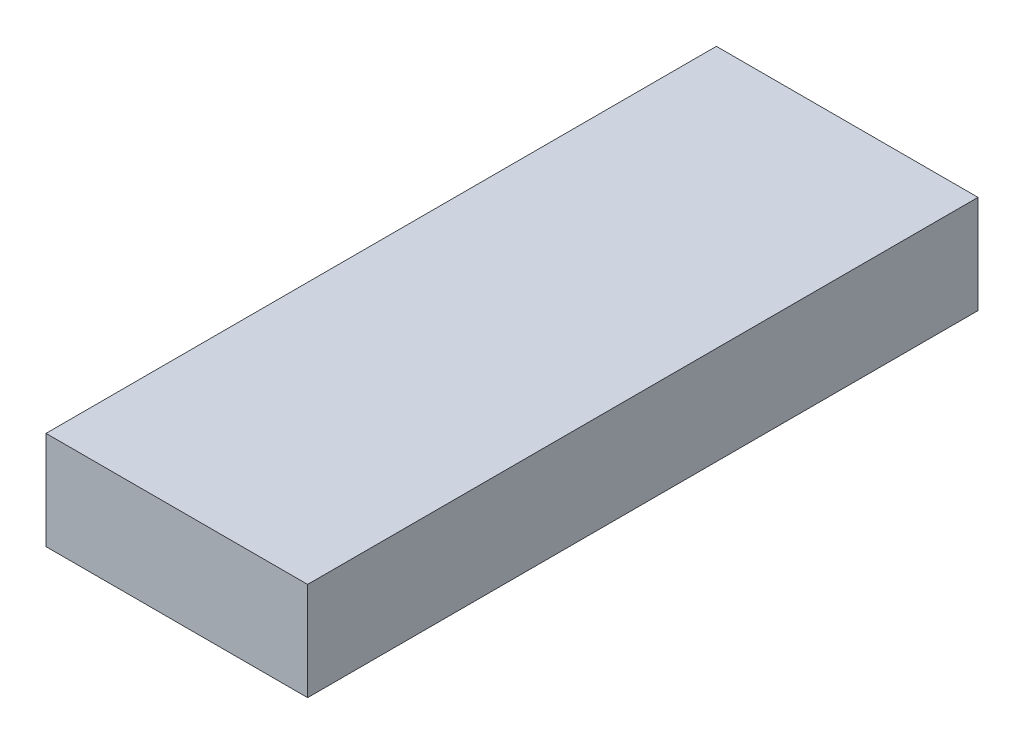
ISO-10303-21;
HEADER;
FILE_DESCRIPTION(('STEP AP214'),'2;1');
FILE_NAME('part.step','',(''),(''),'','','');
FILE_SCHEMA(('AUTOMOTIVE_DESIGN { 1 0 10303 214 1 1 1 1 }'));
ENDSEC;
DATA;
#1=APPLICATION_CONTEXT('core data for automotive mechanical design processes');
#2=APPLICATION_PROTOCOL_DEFINITION('international standard','automotive_design',2000,#1);
#3=PRODUCT_CONTEXT('',#1,'mechanical');
#4=PRODUCT('Part','Part','',(#3));
#5=PRODUCT_RELATED_PRODUCT_CATEGORY('part','',(#4));
#6=PRODUCT_DEFINITION_FORMATION('','',#4);
#7=PRODUCT_DEFINITION_CONTEXT('part definition',#1,'design');
#8=PRODUCT_DEFINITION('design','',#6,#7);
#9=PRODUCT_DEFINITION_SHAPE('','',#8);
#10=(LENGTH_UNIT() NAMED_UNIT(*) SI_UNIT(.MILLI.,.METRE.));
#11=(NAMED_UNIT(*) PLANE_ANGLE_UNIT() SI_UNIT($,.RADIAN.));
#12=(NAMED_UNIT(*) SI_UNIT($,.STERADIAN.) SOLID_ANGLE_UNIT());
#13=UNCERTAINTY_MEASURE_WITH_UNIT(LENGTH_MEASURE(1.E-05),#10,'distance_accuracy_value','');
#14=(GEOMETRIC_REPRESENTATION_CONTEXT(3) GLOBAL_UNCERTAINTY_ASSIGNED_CONTEXT((#13)) GLOBAL_UNIT_ASSIGNED_CONTEXT((#10,
#11,#12)) REPRESENTATION_CONTEXT('',''));
#15=CARTESIAN_POINT('',(0.,0.,0.));
#16=DIRECTION('',(0.,0.,1.));
#17=DIRECTION('',(1.,0.,0.));
#18=AXIS2_PLACEMENT_3D('',#15,#16,#17);
#19=CARTESIAN_POINT('',(0.,30.,0.));
#20=DIRECTION('',(1.,0.,0.));
#21=DIRECTION('',(0.,0.,-1.));
#22=AXIS2_PLACEMENT_3D('',#19,#20,#21);
#23=PLANE('',#22);
#24=DIRECTION('',(0.,0.,1.));
#25=VECTOR('',#24,1.);
#26=CARTESIAN_POINT('',(0.,0.,0.));
#27=LINE('',#26,#25);
#28=CARTESIAN_POINT('',(0.,0.,-205.));
#29=VERTEX_POINT('',#28);
#30=CARTESIAN_POINT('',(0.,0.,0.));
#31=VERTEX_POINT('',#30);
#32=EDGE_CURVE('E95',#29,#31,#27,.T.);
#33=ORIENTED_EDGE('',*,*,#32,.T.);
#34=DIRECTION('',(0.,-1.,0.));
#35=VECTOR('',#34,1.);
#36=CARTESIAN_POINT('',(0.,30.,0.));
#37=LINE('',#36,#35);
#38=CARTESIAN_POINT('',(0.,30.,0.));
#39=VERTEX_POINT('',#38);
#40=EDGE_CURVE('E11',#39,#31,#37,.T.);
#41=ORIENTED_EDGE('',*,*,#40,.F.);
#42=DIRECTION('',(0.,0.,1.));
#43=VECTOR('',#42,1.);
#44=CARTESIAN_POINT('',(0.,30.,0.));
#45=LINE('',#44,#43);
#46=CARTESIAN_POINT('',(0.,30.,-205.));
#47=VERTEX_POINT('',#46);
#48=EDGE_CURVE('E83',#47,#39,#45,.T.);
#49=ORIENTED_EDGE('',*,*,#48,.F.);
#50=DIRECTION('',(0.,-1.,0.));
#51=VECTOR('',#50,1.);
#52=CARTESIAN_POINT('',(0.,30.,-205.));
#53=LINE('',#52,#51);
#54=EDGE_CURVE('E91',#47,#29,#53,.T.);
#55=ORIENTED_EDGE('',*,*,#54,.T.);
#56=EDGE_LOOP('',(#33,#41,#49,#55));
#57=FACE_BOUND('',#56,.T.);
#58=ADVANCED_FACE('F32',(#57),#23,.F.);
#59=CARTESIAN_POINT('',(0.,30.,0.));
#60=DIRECTION('',(0.,0.,-1.));
#61=DIRECTION('',(-1.,0.,0.));
#62=AXIS2_PLACEMENT_3D('',#59,#60,#61);
#63=PLANE('',#62);
#64=DIRECTION('',(1.,0.,0.));
#65=VECTOR('',#64,1.);
#66=CARTESIAN_POINT('',(0.,0.,0.));
#67=LINE('',#66,#65);
#68=CARTESIAN_POINT('',(80.,0.,0.));
#69=VERTEX_POINT('',#68);
#70=EDGE_CURVE('E87',#31,#69,#67,.T.);
#71=ORIENTED_EDGE('',*,*,#70,.T.);
#72=DIRECTION('',(0.,-1.,0.));
#73=VECTOR('',#72,1.);
#74=CARTESIAN_POINT('',(80.,30.,0.));
#75=LINE('',#74,#73);
#76=CARTESIAN_POINT('',(80.,30.,0.));
#77=VERTEX_POINT('',#76);
#78=EDGE_CURVE('E40',#77,#69,#75,.T.);
#79=ORIENTED_EDGE('',*,*,#78,.F.);
#80=DIRECTION('',(1.,0.,0.));
#81=VECTOR('',#80,1.);
#82=CARTESIAN_POINT('',(0.,30.,0.));
#83=LINE('',#82,#81);
#84=EDGE_CURVE('E78',#39,#77,#83,.T.);
#85=ORIENTED_EDGE('',*,*,#84,.F.);
#86=ORIENTED_EDGE('',*,*,#40,.T.);
#87=EDGE_LOOP('',(#71,#79,#85,#86));
#88=FACE_BOUND('',#87,.T.);
#89=ADVANCED_FACE('F86',(#88),#63,.F.);
#90=CARTESIAN_POINT('',(80.,30.,0.));
#91=DIRECTION('',(-1.,0.,0.));
#92=DIRECTION('',(0.,0.,1.));
#93=AXIS2_PLACEMENT_3D('',#90,#91,#92);
#94=PLANE('',#93);
#95=DIRECTION('',(0.,0.,-1.));
#96=VECTOR('',#95,1.);
#97=CARTESIAN_POINT('',(80.,0.,0.));
#98=LINE('',#97,#96);
#99=CARTESIAN_POINT('',(80.,0.,-205.));
#100=VERTEX_POINT('',#99);
#101=EDGE_CURVE('E65',#69,#100,#98,.T.);
#102=ORIENTED_EDGE('',*,*,#101,.T.);
#103=DIRECTION('',(0.,-1.,0.));
#104=VECTOR('',#103,1.);
#105=CARTESIAN_POINT('',(80.,30.,-205.));
#106=LINE('',#105,#104);
#107=CARTESIAN_POINT('',(80.,30.,-205.));
#108=VERTEX_POINT('',#107);
#109=EDGE_CURVE('E88',#108,#100,#106,.T.);
#110=ORIENTED_EDGE('',*,*,#109,.F.);
#111=DIRECTION('',(0.,0.,-1.));
#112=VECTOR('',#111,1.);
#113=CARTESIAN_POINT('',(80.,30.,0.));
#114=LINE('',#113,#112);
#115=EDGE_CURVE('E81',#77,#108,#114,.T.);
#116=ORIENTED_EDGE('',*,*,#115,.F.);
#117=ORIENTED_EDGE('',*,*,#78,.T.);
#118=EDGE_LOOP('',(#102,#110,#116,#117));
#119=FACE_BOUND('',#118,.T.);
#120=ADVANCED_FACE('F89',(#119),#94,.F.);
#121=CARTESIAN_POINT('',(0.,30.,-205.));
#122=DIRECTION('',(0.,0.,1.));
#123=DIRECTION('',(1.,0.,0.));
#124=AXIS2_PLACEMENT_3D('',#121,#122,#123);
#125=PLANE('',#124);
#126=DIRECTION('',(-1.,0.,0.));
#127=VECTOR('',#126,1.);
#128=CARTESIAN_POINT('',(0.,0.,-205.));
#129=LINE('',#128,#127);
#130=EDGE_CURVE('E71',#100,#29,#129,.T.);
#131=ORIENTED_EDGE('',*,*,#130,.T.);
#132=ORIENTED_EDGE('',*,*,#54,.F.);
#133=DIRECTION('',(-1.,0.,0.));
#134=VECTOR('',#133,1.);
#135=CARTESIAN_POINT('',(0.,30.,-205.));
#136=LINE('',#135,#134);
#137=EDGE_CURVE('E48',#108,#47,#136,.T.);
#138=ORIENTED_EDGE('',*,*,#137,.F.);
#139=ORIENTED_EDGE('',*,*,#109,.T.);
#140=EDGE_LOOP('',(#131,#132,#138,#139));
#141=FACE_BOUND('',#140,.T.);
#142=ADVANCED_FACE('F102',(#141),#125,.F.);
#143=CARTESIAN_POINT('',(0.,30.,0.));
#144=DIRECTION('',(0.,-1.,0.));
#145=DIRECTION('',(0.,0.,-1.));
#146=AXIS2_PLACEMENT_3D('',#143,#144,#145);
#147=PLANE('',#146);
#148=ORIENTED_EDGE('',*,*,#48,.T.);
#149=ORIENTED_EDGE('',*,*,#84,.T.);
#150=ORIENTED_EDGE('',*,*,#115,.T.);
#151=ORIENTED_EDGE('',*,*,#137,.T.);
#152=EDGE_LOOP('',(#148,#149,#150,#151));
#153=FACE_BOUND('',#152,.T.);
#154=ADVANCED_FACE('F79',(#153),#147,.F.);
#155=CARTESIAN_POINT('',(0.,0.,0.));
#156=DIRECTION('',(0.,-1.,0.));
#157=DIRECTION('',(0.,0.,-1.));
#158=AXIS2_PLACEMENT_3D('',#155,#156,#157);
#159=PLANE('',#158);
#160=ORIENTED_EDGE('',*,*,#32,.F.);
#161=ORIENTED_EDGE('',*,*,#130,.F.);
#162=ORIENTED_EDGE('',*,*,#101,.F.);
#163=ORIENTED_EDGE('',*,*,#70,.F.);
#164=EDGE_LOOP('',(#160,#161,#162,#163));
#165=FACE_BOUND('',#164,.T.);
#166=ADVANCED_FACE('F105',(#165),#159,.T.);
#167=CLOSED_SHELL('',(#58,#89,#120,#142,#154,#166));
#168=MANIFOLD_SOLID_BREP('B2',#167);
#169=ADVANCED_BREP_SHAPE_REPRESENTATION('',(#18,#168),#14);
#170=SHAPE_DEFINITION_REPRESENTATION(#9,#169);
ENDSEC;
END-ISO-10303-21;
